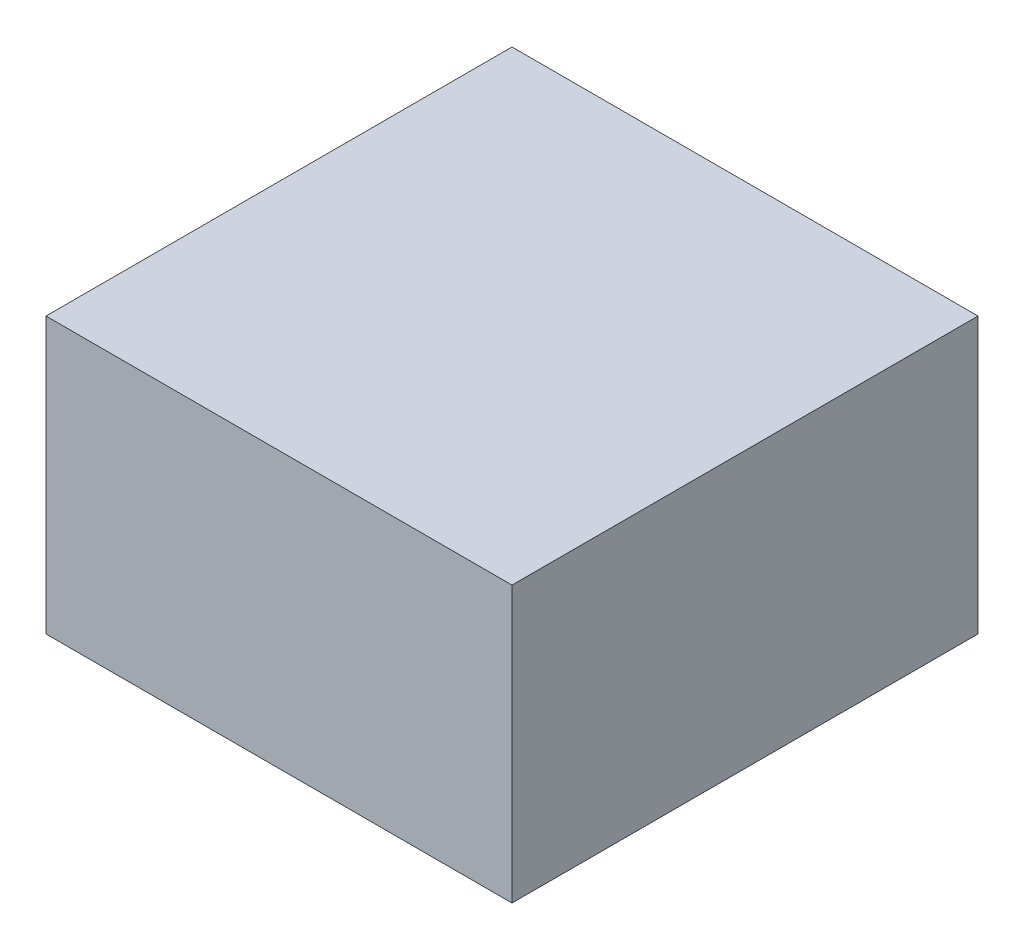
ISO-10303-21;
HEADER;
FILE_DESCRIPTION(('STEP AP214'),'2;1');
FILE_NAME('part.step','',(''),(''),'','','');
FILE_SCHEMA(('AUTOMOTIVE_DESIGN { 1 0 10303 214 1 1 1 1 }'));
ENDSEC;
DATA;
#1=APPLICATION_CONTEXT('core data for automotive mechanical design processes');
#2=APPLICATION_PROTOCOL_DEFINITION('international standard','automotive_design',2000,#1);
#3=PRODUCT_CONTEXT('',#1,'mechanical');
#4=PRODUCT('Part','Part','',(#3));
#5=PRODUCT_RELATED_PRODUCT_CATEGORY('part','',(#4));
#6=PRODUCT_DEFINITION_FORMATION('','',#4);
#7=PRODUCT_DEFINITION_CONTEXT('part definition',#1,'design');
#8=PRODUCT_DEFINITION('design','',#6,#7);
#9=PRODUCT_DEFINITION_SHAPE('','',#8);
#10=(LENGTH_UNIT() NAMED_UNIT(*) SI_UNIT(.MILLI.,.METRE.));
#11=(NAMED_UNIT(*) PLANE_ANGLE_UNIT() SI_UNIT($,.RADIAN.));
#12=(NAMED_UNIT(*) SI_UNIT($,.STERADIAN.) SOLID_ANGLE_UNIT());
#13=UNCERTAINTY_MEASURE_WITH_UNIT(LENGTH_MEASURE(1.E-05),#10,'distance_accuracy_value','');
#14=(GEOMETRIC_REPRESENTATION_CONTEXT(3) GLOBAL_UNCERTAINTY_ASSIGNED_CONTEXT((#13)) GLOBAL_UNIT_ASSIGNED_CONTEXT((#10,
#11,#12)) REPRESENTATION_CONTEXT('',''));
#15=CARTESIAN_POINT('',(0.,0.,0.));
#16=DIRECTION('',(0.,0.,1.));
#17=DIRECTION('',(1.,0.,0.));
#18=AXIS2_PLACEMENT_3D('',#15,#16,#17);
#19=CARTESIAN_POINT('',(-55.,65.,55.));
#20=DIRECTION('',(1.,0.,0.));
#21=DIRECTION('',(0.,0.,-1.));
#22=AXIS2_PLACEMENT_3D('',#19,#20,#21);
#23=PLANE('',#22);
#24=DIRECTION('',(0.,0.,1.));
#25=VECTOR('',#24,1.);
#26=CARTESIAN_POINT('',(-55.,0.,55.));
#27=LINE('',#26,#25);
#28=CARTESIAN_POINT('',(-55.,0.,-55.));
#29=VERTEX_POINT('',#28);
#30=CARTESIAN_POINT('',(-55.,0.,55.));
#31=VERTEX_POINT('',#30);
#32=EDGE_CURVE('E113',#29,#31,#27,.T.);
#33=ORIENTED_EDGE('',*,*,#32,.T.);
#34=DIRECTION('',(0.,-1.,0.));
#35=VECTOR('',#34,1.);
#36=CARTESIAN_POINT('',(-55.,65.,55.));
#37=LINE('',#36,#35);
#38=CARTESIAN_POINT('',(-55.,65.,55.));
#39=VERTEX_POINT('',#38);
#40=EDGE_CURVE('E11',#39,#31,#37,.T.);
#41=ORIENTED_EDGE('',*,*,#40,.F.);
#42=DIRECTION('',(0.,0.,1.));
#43=VECTOR('',#42,1.);
#44=CARTESIAN_POINT('',(-55.,65.,55.));
#45=LINE('',#44,#43);
#46=CARTESIAN_POINT('',(-55.,65.,-55.));
#47=VERTEX_POINT('',#46);
#48=EDGE_CURVE('E97',#47,#39,#45,.T.);
#49=ORIENTED_EDGE('',*,*,#48,.F.);
#50=DIRECTION('',(0.,-1.,0.));
#51=VECTOR('',#50,1.);
#52=CARTESIAN_POINT('',(-55.,65.,-55.));
#53=LINE('',#52,#51);
#54=EDGE_CURVE('E109',#47,#29,#53,.T.);
#55=ORIENTED_EDGE('',*,*,#54,.T.);
#56=EDGE_LOOP('',(#33,#41,#49,#55));
#57=FACE_BOUND('',#56,.T.);
#58=ADVANCED_FACE('F45',(#57),#23,.F.);
#59=CARTESIAN_POINT('',(55.,65.,55.));
#60=DIRECTION('',(0.,0.,-1.));
#61=DIRECTION('',(-1.,0.,0.));
#62=AXIS2_PLACEMENT_3D('',#59,#60,#61);
#63=PLANE('',#62);
#64=DIRECTION('',(1.,0.,0.));
#65=VECTOR('',#64,1.);
#66=CARTESIAN_POINT('',(55.,0.,55.));
#67=LINE('',#66,#65);
#68=CARTESIAN_POINT('',(55.,0.,55.));
#69=VERTEX_POINT('',#68);
#70=EDGE_CURVE('E102',#31,#69,#67,.T.);
#71=ORIENTED_EDGE('',*,*,#70,.T.);
#72=DIRECTION('',(0.,-1.,0.));
#73=VECTOR('',#72,1.);
#74=CARTESIAN_POINT('',(55.,65.,55.));
#75=LINE('',#74,#73);
#76=CARTESIAN_POINT('',(55.,65.,55.));
#77=VERTEX_POINT('',#76);
#78=EDGE_CURVE('E54',#77,#69,#75,.T.);
#79=ORIENTED_EDGE('',*,*,#78,.F.);
#80=DIRECTION('',(1.,0.,0.));
#81=VECTOR('',#80,1.);
#82=CARTESIAN_POINT('',(55.,65.,55.));
#83=LINE('',#82,#81);
#84=EDGE_CURVE('E92',#39,#77,#83,.T.);
#85=ORIENTED_EDGE('',*,*,#84,.F.);
#86=ORIENTED_EDGE('',*,*,#40,.T.);
#87=EDGE_LOOP('',(#71,#79,#85,#86));
#88=FACE_BOUND('',#87,.T.);
#89=ADVANCED_FACE('F101',(#88),#63,.F.);
#90=CARTESIAN_POINT('',(55.,65.,55.));
#91=DIRECTION('',(-1.,0.,0.));
#92=DIRECTION('',(0.,0.,1.));
#93=AXIS2_PLACEMENT_3D('',#90,#91,#92);
#94=PLANE('',#93);
#95=DIRECTION('',(0.,0.,-1.));
#96=VECTOR('',#95,1.);
#97=CARTESIAN_POINT('',(55.,0.,55.));
#98=LINE('',#97,#96);
#99=CARTESIAN_POINT('',(55.,0.,-55.));
#100=VERTEX_POINT('',#99);
#101=EDGE_CURVE('E79',#69,#100,#98,.T.);
#102=ORIENTED_EDGE('',*,*,#101,.T.);
#103=DIRECTION('',(0.,-1.,0.));
#104=VECTOR('',#103,1.);
#105=CARTESIAN_POINT('',(55.,65.,-55.));
#106=LINE('',#105,#104);
#107=CARTESIAN_POINT('',(55.,65.,-55.));
#108=VERTEX_POINT('',#107);
#109=EDGE_CURVE('E104',#108,#100,#106,.T.);
#110=ORIENTED_EDGE('',*,*,#109,.F.);
#111=DIRECTION('',(0.,0.,-1.));
#112=VECTOR('',#111,1.);
#113=CARTESIAN_POINT('',(55.,65.,55.));
#114=LINE('',#113,#112);
#115=EDGE_CURVE('E95',#77,#108,#114,.T.);
#116=ORIENTED_EDGE('',*,*,#115,.F.);
#117=ORIENTED_EDGE('',*,*,#78,.T.);
#118=EDGE_LOOP('',(#102,#110,#116,#117));
#119=FACE_BOUND('',#118,.T.);
#120=ADVANCED_FACE('F105',(#119),#94,.F.);
#121=CARTESIAN_POINT('',(55.,65.,-55.));
#122=DIRECTION('',(0.,0.,1.));
#123=DIRECTION('',(1.,0.,0.));
#124=AXIS2_PLACEMENT_3D('',#121,#122,#123);
#125=PLANE('',#124);
#126=DIRECTION('',(-1.,0.,0.));
#127=VECTOR('',#126,1.);
#128=CARTESIAN_POINT('',(55.,0.,-55.));
#129=LINE('',#128,#127);
#130=EDGE_CURVE('E85',#100,#29,#129,.T.);
#131=ORIENTED_EDGE('',*,*,#130,.T.);
#132=ORIENTED_EDGE('',*,*,#54,.F.);
#133=DIRECTION('',(-1.,0.,0.));
#134=VECTOR('',#133,1.);
#135=CARTESIAN_POINT('',(55.,65.,-55.));
#136=LINE('',#135,#134);
#137=EDGE_CURVE('E62',#108,#47,#136,.T.);
#138=ORIENTED_EDGE('',*,*,#137,.F.);
#139=ORIENTED_EDGE('',*,*,#109,.T.);
#140=EDGE_LOOP('',(#131,#132,#138,#139));
#141=FACE_BOUND('',#140,.T.);
#142=ADVANCED_FACE('F126',(#141),#125,.F.);
#143=CARTESIAN_POINT('',(0.,65.,0.));
#144=DIRECTION('',(0.,1.,0.));
#145=DIRECTION('',(0.,0.,1.));
#146=AXIS2_PLACEMENT_3D('',#143,#144,#145);
#147=PLANE('',#146);
#148=ORIENTED_EDGE('',*,*,#48,.T.);
#149=ORIENTED_EDGE('',*,*,#84,.T.);
#150=ORIENTED_EDGE('',*,*,#115,.T.);
#151=ORIENTED_EDGE('',*,*,#137,.T.);
#152=EDGE_LOOP('',(#148,#149,#150,#151));
#153=FACE_BOUND('',#152,.T.);
#154=ADVANCED_FACE('F93',(#153),#147,.T.);
#155=CARTESIAN_POINT('',(0.,0.,0.));
#156=DIRECTION('',(0.,1.,0.));
#157=DIRECTION('',(0.,0.,1.));
#158=AXIS2_PLACEMENT_3D('',#155,#156,#157);
#159=PLANE('',#158);
#160=ORIENTED_EDGE('',*,*,#32,.F.);
#161=ORIENTED_EDGE('',*,*,#130,.F.);
#162=ORIENTED_EDGE('',*,*,#101,.F.);
#163=ORIENTED_EDGE('',*,*,#70,.F.);
#164=EDGE_LOOP('',(#160,#161,#162,#163));
#165=FACE_BOUND('',#164,.T.);
#166=ADVANCED_FACE('F129',(#165),#159,.F.);
#167=CLOSED_SHELL('',(#58,#89,#120,#142,#154,#166));
#168=MANIFOLD_SOLID_BREP('B2',#167);
#169=ADVANCED_BREP_SHAPE_REPRESENTATION('',(#18,#168),#14);
#170=SHAPE_DEFINITION_REPRESENTATION(#9,#169);
ENDSEC;
END-ISO-10303-21;
